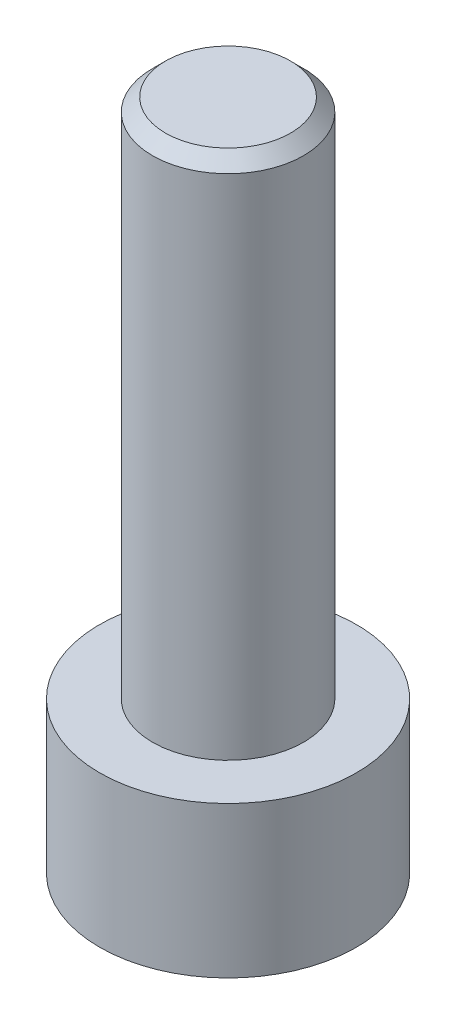
ISO-10303-21;
HEADER;
FILE_DESCRIPTION(('STEP AP214'),'2;1');
FILE_NAME('part.step','',(''),(''),'','','');
FILE_SCHEMA(('AUTOMOTIVE_DESIGN { 1 0 10303 214 1 1 1 1 }'));
ENDSEC;
DATA;
#1=APPLICATION_CONTEXT('core data for automotive mechanical design processes');
#2=APPLICATION_PROTOCOL_DEFINITION('international standard','automotive_design',2000,#1);
#3=PRODUCT_CONTEXT('',#1,'mechanical');
#4=PRODUCT('Part','Part','',(#3));
#5=PRODUCT_RELATED_PRODUCT_CATEGORY('part','',(#4));
#6=PRODUCT_DEFINITION_FORMATION('','',#4);
#7=PRODUCT_DEFINITION_CONTEXT('part definition',#1,'design');
#8=PRODUCT_DEFINITION('design','',#6,#7);
#9=PRODUCT_DEFINITION_SHAPE('','',#8);
#10=(LENGTH_UNIT() NAMED_UNIT(*) SI_UNIT(.MILLI.,.METRE.));
#11=(NAMED_UNIT(*) PLANE_ANGLE_UNIT() SI_UNIT($,.RADIAN.));
#12=(NAMED_UNIT(*) SI_UNIT($,.STERADIAN.) SOLID_ANGLE_UNIT());
#13=UNCERTAINTY_MEASURE_WITH_UNIT(LENGTH_MEASURE(1.E-05),#10,'distance_accuracy_value','');
#14=(GEOMETRIC_REPRESENTATION_CONTEXT(3) GLOBAL_UNCERTAINTY_ASSIGNED_CONTEXT((#13)) GLOBAL_UNIT_ASSIGNED_CONTEXT((#10,
#11,#12)) REPRESENTATION_CONTEXT('',''));
#15=CARTESIAN_POINT('',(0.,0.,0.));
#16=DIRECTION('',(0.,0.,1.));
#17=DIRECTION('',(1.,0.,0.));
#18=AXIS2_PLACEMENT_3D('',#15,#16,#17);
#19=CARTESIAN_POINT('',(0.,2.9,0.));
#20=DIRECTION('',(0.,-1.,0.));
#21=DIRECTION('',(0.,0.,-1.));
#22=AXIS2_PLACEMENT_3D('',#19,#20,#21);
#23=CYLINDRICAL_SURFACE('',#22,2.465);
#24=CARTESIAN_POINT('',(0.,2.9,0.));
#25=DIRECTION('',(0.,1.,0.));
#26=DIRECTION('',(0.,0.,1.));
#27=AXIS2_PLACEMENT_3D('',#24,#25,#26);
#28=CIRCLE('',#27,2.465);
#29=CARTESIAN_POINT('',(0.,2.9,2.465));
#30=VERTEX_POINT('',#29);
#31=EDGE_CURVE('E177',#30,#30,#28,.T.);
#32=ORIENTED_EDGE('',*,*,#31,.F.);
#33=EDGE_LOOP('',(#32));
#34=FACE_BOUND('',#33,.T.);
#35=CARTESIAN_POINT('',(0.,0.,0.));
#36=DIRECTION('',(0.,1.,0.));
#37=DIRECTION('',(0.,0.,1.));
#38=AXIS2_PLACEMENT_3D('',#35,#36,#37);
#39=CIRCLE('',#38,2.465);
#40=CARTESIAN_POINT('',(0.,0.,2.465));
#41=VERTEX_POINT('',#40);
#42=EDGE_CURVE('E163',#41,#41,#39,.T.);
#43=ORIENTED_EDGE('',*,*,#42,.T.);
#44=EDGE_LOOP('',(#43));
#45=FACE_BOUND('',#44,.T.);
#46=ADVANCED_FACE('F47',(#34,#45),#23,.T.);
#47=CARTESIAN_POINT('',(0.,2.9,0.));
#48=DIRECTION('',(0.,1.,0.));
#49=DIRECTION('',(0.,0.,1.));
#50=AXIS2_PLACEMENT_3D('',#47,#48,#49);
#51=PLANE('',#50);
#52=CARTESIAN_POINT('',(0.,2.9,0.));
#53=DIRECTION('',(0.,1.,0.));
#54=DIRECTION('',(0.,0.,1.));
#55=AXIS2_PLACEMENT_3D('',#52,#53,#54);
#56=CIRCLE('',#55,1.45);
#57=CARTESIAN_POINT('',(0.,2.9,1.45));
#58=VERTEX_POINT('',#57);
#59=EDGE_CURVE('E173',#58,#58,#56,.T.);
#60=ORIENTED_EDGE('',*,*,#59,.F.);
#61=EDGE_LOOP('',(#60));
#62=FACE_BOUND('',#61,.T.);
#63=ORIENTED_EDGE('',*,*,#31,.T.);
#64=EDGE_LOOP('',(#63));
#65=FACE_BOUND('',#64,.T.);
#66=ADVANCED_FACE('F199',(#62,#65),#51,.T.);
#67=CARTESIAN_POINT('',(0.,0.,0.));
#68=DIRECTION('',(0.,1.,0.));
#69=DIRECTION('',(0.,0.,1.));
#70=AXIS2_PLACEMENT_3D('',#67,#68,#69);
#71=PLANE('',#70);
#72=DIRECTION('',(0.5,0.,0.866025403784439));
#73=VECTOR('',#72,1.);
#74=CARTESIAN_POINT('',(0.733234841870825,0.,-1.27));
#75=LINE('',#74,#73);
#76=CARTESIAN_POINT('',(0.733234841870825,0.,-1.27));
#77=VERTEX_POINT('',#76);
#78=CARTESIAN_POINT('',(1.46646968374165,0.,0.));
#79=VERTEX_POINT('',#78);
#80=EDGE_CURVE('E144',#77,#79,#75,.T.);
#81=ORIENTED_EDGE('',*,*,#80,.F.);
#82=DIRECTION('',(1.,0.,0.));
#83=VECTOR('',#82,1.);
#84=CARTESIAN_POINT('',(-0.733234841870825,0.,-1.27));
#85=LINE('',#84,#83);
#86=CARTESIAN_POINT('',(-0.733234841870825,0.,-1.27));
#87=VERTEX_POINT('',#86);
#88=EDGE_CURVE('E64',#87,#77,#85,.T.);
#89=ORIENTED_EDGE('',*,*,#88,.F.);
#90=DIRECTION('',(0.5,0.,-0.866025403784438));
#91=VECTOR('',#90,1.);
#92=CARTESIAN_POINT('',(-1.46646968374165,0.,0.));
#93=LINE('',#92,#91);
#94=CARTESIAN_POINT('',(-1.46646968374165,0.,0.));
#95=VERTEX_POINT('',#94);
#96=EDGE_CURVE('E157',#95,#87,#93,.T.);
#97=ORIENTED_EDGE('',*,*,#96,.F.);
#98=DIRECTION('',(-0.5,0.,-0.866025403784439));
#99=VECTOR('',#98,1.);
#100=CARTESIAN_POINT('',(-0.733234841870825,0.,1.27));
#101=LINE('',#100,#99);
#102=CARTESIAN_POINT('',(-0.733234841870825,0.,1.27));
#103=VERTEX_POINT('',#102);
#104=EDGE_CURVE('E154',#103,#95,#101,.T.);
#105=ORIENTED_EDGE('',*,*,#104,.F.);
#106=DIRECTION('',(-1.,0.,0.));
#107=VECTOR('',#106,1.);
#108=CARTESIAN_POINT('',(0.733234841870825,0.,1.27));
#109=LINE('',#108,#107);
#110=CARTESIAN_POINT('',(0.733234841870825,0.,1.27));
#111=VERTEX_POINT('',#110);
#112=EDGE_CURVE('E112',#111,#103,#109,.T.);
#113=ORIENTED_EDGE('',*,*,#112,.F.);
#114=DIRECTION('',(-0.5,0.,0.866025403784439));
#115=VECTOR('',#114,1.);
#116=CARTESIAN_POINT('',(1.46646968374165,0.,0.));
#117=LINE('',#116,#115);
#118=EDGE_CURVE('E148',#79,#111,#117,.T.);
#119=ORIENTED_EDGE('',*,*,#118,.F.);
#120=EDGE_LOOP('',(#81,#89,#97,#105,#113,#119));
#121=FACE_BOUND('',#120,.T.);
#122=ORIENTED_EDGE('',*,*,#42,.F.);
#123=EDGE_LOOP('',(#122));
#124=FACE_BOUND('',#123,.T.);
#125=ADVANCED_FACE('F204',(#121,#124),#71,.F.);
#126=CARTESIAN_POINT('',(0.,12.9,0.));
#127=DIRECTION('',(0.,-1.,0.));
#128=DIRECTION('',(0.,0.,-1.));
#129=AXIS2_PLACEMENT_3D('',#126,#127,#128);
#130=CYLINDRICAL_SURFACE('',#129,1.45);
#131=CARTESIAN_POINT('',(0.,12.65,0.));
#132=DIRECTION('',(0.,1.,0.));
#133=DIRECTION('',(0.,0.,1.));
#134=AXIS2_PLACEMENT_3D('',#131,#132,#133);
#135=CIRCLE('',#134,1.45);
#136=CARTESIAN_POINT('',(0.,12.65,1.45));
#137=VERTEX_POINT('',#136);
#138=EDGE_CURVE('E11',#137,#137,#135,.F.);
#139=ORIENTED_EDGE('',*,*,#138,.T.);
#140=EDGE_LOOP('',(#139));
#141=FACE_BOUND('',#140,.T.);
#142=ORIENTED_EDGE('',*,*,#59,.T.);
#143=EDGE_LOOP('',(#142));
#144=FACE_BOUND('',#143,.T.);
#145=ADVANCED_FACE('F211',(#141,#144),#130,.T.);
#146=CARTESIAN_POINT('',(0.,12.9,0.));
#147=DIRECTION('',(0.,1.,0.));
#148=DIRECTION('',(0.,0.,1.));
#149=AXIS2_PLACEMENT_3D('',#146,#147,#148);
#150=PLANE('',#149);
#151=CARTESIAN_POINT('',(0.,12.9,0.));
#152=DIRECTION('',(0.,1.,0.));
#153=DIRECTION('',(0.,0.,1.));
#154=AXIS2_PLACEMENT_3D('',#151,#152,#153);
#155=CIRCLE('',#154,1.2);
#156=CARTESIAN_POINT('',(0.,12.9,1.2));
#157=VERTEX_POINT('',#156);
#158=EDGE_CURVE('E57',#157,#157,#155,.T.);
#159=ORIENTED_EDGE('',*,*,#158,.T.);
#160=EDGE_LOOP('',(#159));
#161=FACE_BOUND('',#160,.T.);
#162=ADVANCED_FACE('F187',(#161),#150,.T.);
#163=CARTESIAN_POINT('',(-0.733234841870825,1.9,-1.27));
#164=DIRECTION('',(0.,0.,-1.));
#165=DIRECTION('',(-1.,0.,0.));
#166=AXIS2_PLACEMENT_3D('',#163,#164,#165);
#167=PLANE('',#166);
#168=ORIENTED_EDGE('',*,*,#88,.T.);
#169=DIRECTION('',(0.,-1.,0.));
#170=VECTOR('',#169,1.);
#171=CARTESIAN_POINT('',(0.733234841870825,1.9,-1.27));
#172=LINE('',#171,#170);
#173=CARTESIAN_POINT('',(0.733234841870825,1.9,-1.27));
#174=VERTEX_POINT('',#173);
#175=EDGE_CURVE('E94',#174,#77,#172,.T.);
#176=ORIENTED_EDGE('',*,*,#175,.F.);
#177=DIRECTION('',(1.,0.,0.));
#178=VECTOR('',#177,1.);
#179=CARTESIAN_POINT('',(-0.733234841870825,1.9,-1.27));
#180=LINE('',#179,#178);
#181=CARTESIAN_POINT('',(-0.733234841870825,1.9,-1.27));
#182=VERTEX_POINT('',#181);
#183=EDGE_CURVE('E160',#182,#174,#180,.T.);
#184=ORIENTED_EDGE('',*,*,#183,.F.);
#185=DIRECTION('',(0.,-1.,0.));
#186=VECTOR('',#185,1.);
#187=CARTESIAN_POINT('',(-0.733234841870825,1.9,-1.27));
#188=LINE('',#187,#186);
#189=EDGE_CURVE('E72',#182,#87,#188,.T.);
#190=ORIENTED_EDGE('',*,*,#189,.T.);
#191=EDGE_LOOP('',(#168,#176,#184,#190));
#192=FACE_BOUND('',#191,.T.);
#193=ADVANCED_FACE('F218',(#192),#167,.F.);
#194=CARTESIAN_POINT('',(-1.46646968374165,1.9,0.));
#195=DIRECTION('',(-0.866025403784439,0.,-0.5));
#196=DIRECTION('',(-0.5,0.,0.866025403784439));
#197=AXIS2_PLACEMENT_3D('',#194,#195,#196);
#198=PLANE('',#197);
#199=ORIENTED_EDGE('',*,*,#96,.T.);
#200=ORIENTED_EDGE('',*,*,#189,.F.);
#201=DIRECTION('',(0.5,0.,-0.866025403784438));
#202=VECTOR('',#201,1.);
#203=CARTESIAN_POINT('',(-1.46646968374165,1.9,0.));
#204=LINE('',#203,#202);
#205=CARTESIAN_POINT('',(-1.46646968374165,1.9,0.));
#206=VERTEX_POINT('',#205);
#207=EDGE_CURVE('E126',#206,#182,#204,.T.);
#208=ORIENTED_EDGE('',*,*,#207,.F.);
#209=DIRECTION('',(0.,-1.,0.));
#210=VECTOR('',#209,1.);
#211=CARTESIAN_POINT('',(-1.46646968374165,1.9,0.));
#212=LINE('',#211,#210);
#213=EDGE_CURVE('E117',#206,#95,#212,.T.);
#214=ORIENTED_EDGE('',*,*,#213,.T.);
#215=EDGE_LOOP('',(#199,#200,#208,#214));
#216=FACE_BOUND('',#215,.T.);
#217=ADVANCED_FACE('F221',(#216),#198,.F.);
#218=CARTESIAN_POINT('',(-0.733234841870825,1.9,1.27));
#219=DIRECTION('',(-0.866025403784438,0.,0.5));
#220=DIRECTION('',(0.5,0.,0.866025403784439));
#221=AXIS2_PLACEMENT_3D('',#218,#219,#220);
#222=PLANE('',#221);
#223=ORIENTED_EDGE('',*,*,#104,.T.);
#224=ORIENTED_EDGE('',*,*,#213,.F.);
#225=DIRECTION('',(-0.5,0.,-0.866025403784439));
#226=VECTOR('',#225,1.);
#227=CARTESIAN_POINT('',(-0.733234841870825,1.9,1.27));
#228=LINE('',#227,#226);
#229=CARTESIAN_POINT('',(-0.733234841870825,1.9,1.27));
#230=VERTEX_POINT('',#229);
#231=EDGE_CURVE('E121',#230,#206,#228,.T.);
#232=ORIENTED_EDGE('',*,*,#231,.F.);
#233=DIRECTION('',(0.,-1.,0.));
#234=VECTOR('',#233,1.);
#235=CARTESIAN_POINT('',(-0.733234841870825,1.9,1.27));
#236=LINE('',#235,#234);
#237=EDGE_CURVE('E105',#230,#103,#236,.T.);
#238=ORIENTED_EDGE('',*,*,#237,.T.);
#239=EDGE_LOOP('',(#223,#224,#232,#238));
#240=FACE_BOUND('',#239,.T.);
#241=ADVANCED_FACE('F122',(#240),#222,.F.);
#242=CARTESIAN_POINT('',(0.733234841870825,1.9,1.27));
#243=DIRECTION('',(0.,0.,1.));
#244=DIRECTION('',(1.,0.,0.));
#245=AXIS2_PLACEMENT_3D('',#242,#243,#244);
#246=PLANE('',#245);
#247=ORIENTED_EDGE('',*,*,#112,.T.);
#248=ORIENTED_EDGE('',*,*,#237,.F.);
#249=DIRECTION('',(-1.,0.,0.));
#250=VECTOR('',#249,1.);
#251=CARTESIAN_POINT('',(0.733234841870825,1.9,1.27));
#252=LINE('',#251,#250);
#253=CARTESIAN_POINT('',(0.733234841870825,1.9,1.27));
#254=VERTEX_POINT('',#253);
#255=EDGE_CURVE('E109',#254,#230,#252,.T.);
#256=ORIENTED_EDGE('',*,*,#255,.F.);
#257=DIRECTION('',(0.,-1.,0.));
#258=VECTOR('',#257,1.);
#259=CARTESIAN_POINT('',(0.733234841870825,1.9,1.27));
#260=LINE('',#259,#258);
#261=EDGE_CURVE('E118',#254,#111,#260,.T.);
#262=ORIENTED_EDGE('',*,*,#261,.T.);
#263=EDGE_LOOP('',(#247,#248,#256,#262));
#264=FACE_BOUND('',#263,.T.);
#265=ADVANCED_FACE('F107',(#264),#246,.F.);
#266=CARTESIAN_POINT('',(1.46646968374165,1.9,0.));
#267=DIRECTION('',(0.866025403784438,0.,0.5));
#268=DIRECTION('',(0.5,0.,-0.866025403784439));
#269=AXIS2_PLACEMENT_3D('',#266,#267,#268);
#270=PLANE('',#269);
#271=ORIENTED_EDGE('',*,*,#118,.T.);
#272=ORIENTED_EDGE('',*,*,#261,.F.);
#273=DIRECTION('',(-0.5,0.,0.866025403784439));
#274=VECTOR('',#273,1.);
#275=CARTESIAN_POINT('',(1.46646968374165,1.9,0.));
#276=LINE('',#275,#274);
#277=CARTESIAN_POINT('',(1.46646968374165,1.9,0.));
#278=VERTEX_POINT('',#277);
#279=EDGE_CURVE('E132',#278,#254,#276,.T.);
#280=ORIENTED_EDGE('',*,*,#279,.F.);
#281=DIRECTION('',(0.,-1.,0.));
#282=VECTOR('',#281,1.);
#283=CARTESIAN_POINT('',(1.46646968374165,1.9,0.));
#284=LINE('',#283,#282);
#285=EDGE_CURVE('E168',#278,#79,#284,.T.);
#286=ORIENTED_EDGE('',*,*,#285,.T.);
#287=EDGE_LOOP('',(#271,#272,#280,#286));
#288=FACE_BOUND('',#287,.T.);
#289=ADVANCED_FACE('F224',(#288),#270,.F.);
#290=CARTESIAN_POINT('',(0.733234841870825,1.9,-1.27));
#291=DIRECTION('',(0.866025403784438,0.,-0.5));
#292=DIRECTION('',(-0.5,0.,-0.866025403784439));
#293=AXIS2_PLACEMENT_3D('',#290,#291,#292);
#294=PLANE('',#293);
#295=ORIENTED_EDGE('',*,*,#80,.T.);
#296=ORIENTED_EDGE('',*,*,#285,.F.);
#297=DIRECTION('',(0.5,0.,0.866025403784439));
#298=VECTOR('',#297,1.);
#299=CARTESIAN_POINT('',(0.733234841870825,1.9,-1.27));
#300=LINE('',#299,#298);
#301=EDGE_CURVE('E136',#174,#278,#300,.T.);
#302=ORIENTED_EDGE('',*,*,#301,.F.);
#303=ORIENTED_EDGE('',*,*,#175,.T.);
#304=EDGE_LOOP('',(#295,#296,#302,#303));
#305=FACE_BOUND('',#304,.T.);
#306=ADVANCED_FACE('F195',(#305),#294,.F.);
#307=CARTESIAN_POINT('',(0.,1.9,0.));
#308=DIRECTION('',(0.,-1.,0.));
#309=DIRECTION('',(0.,0.,-1.));
#310=AXIS2_PLACEMENT_3D('',#307,#308,#309);
#311=PLANE('',#310);
#312=ORIENTED_EDGE('',*,*,#183,.T.);
#313=ORIENTED_EDGE('',*,*,#301,.T.);
#314=ORIENTED_EDGE('',*,*,#279,.T.);
#315=ORIENTED_EDGE('',*,*,#255,.T.);
#316=ORIENTED_EDGE('',*,*,#231,.T.);
#317=ORIENTED_EDGE('',*,*,#207,.T.);
#318=EDGE_LOOP('',(#312,#313,#314,#315,#316,#317));
#319=FACE_BOUND('',#318,.T.);
#320=ADVANCED_FACE('F129',(#319),#311,.T.);
#321=CARTESIAN_POINT('',(0.,12.9,0.));
#322=DIRECTION('',(0.,-1.,0.));
#323=DIRECTION('',(0.,0.,-1.));
#324=AXIS2_PLACEMENT_3D('',#321,#322,#323);
#325=CONICAL_SURFACE('',#324,1.2,0.785398163397448);
#326=ORIENTED_EDGE('',*,*,#138,.F.);
#327=EDGE_LOOP('',(#326));
#328=FACE_BOUND('',#327,.T.);
#329=ORIENTED_EDGE('',*,*,#158,.F.);
#330=EDGE_LOOP('',(#329));
#331=FACE_BOUND('',#330,.T.);
#332=ADVANCED_FACE('F50',(#328,#331),#325,.T.);
#333=CLOSED_SHELL('',(#46,#66,#125,#145,#162,#193,#217,#241,#265,#289,#306,#320,#332));
#334=MANIFOLD_SOLID_BREP('B2',#333);
#335=ADVANCED_BREP_SHAPE_REPRESENTATION('',(#18,#334),#14);
#336=SHAPE_DEFINITION_REPRESENTATION(#9,#335);
ENDSEC;
END-ISO-10303-21;
